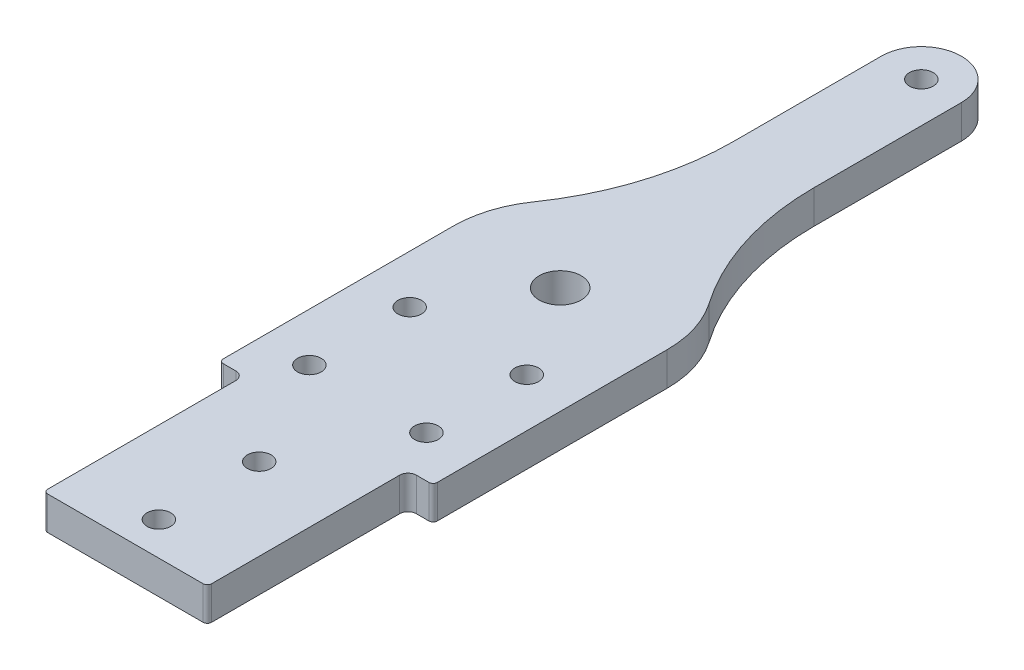
ISO-10303-21;
HEADER;
FILE_DESCRIPTION(('STEP AP214'),'2;1');
FILE_NAME('part.step','',(''),(''),'','','');
FILE_SCHEMA(('AUTOMOTIVE_DESIGN { 1 0 10303 214 1 1 1 1 }'));
ENDSEC;
DATA;
#1=APPLICATION_CONTEXT('core data for automotive mechanical design processes');
#2=APPLICATION_PROTOCOL_DEFINITION('international standard','automotive_design',2000,#1);
#3=PRODUCT_CONTEXT('',#1,'mechanical');
#4=PRODUCT('Part','Part','',(#3));
#5=PRODUCT_RELATED_PRODUCT_CATEGORY('part','',(#4));
#6=PRODUCT_DEFINITION_FORMATION('','',#4);
#7=PRODUCT_DEFINITION_CONTEXT('part definition',#1,'design');
#8=PRODUCT_DEFINITION('design','',#6,#7);
#9=PRODUCT_DEFINITION_SHAPE('','',#8);
#10=(LENGTH_UNIT() NAMED_UNIT(*) SI_UNIT(.MILLI.,.METRE.));
#11=(NAMED_UNIT(*) PLANE_ANGLE_UNIT() SI_UNIT($,.RADIAN.));
#12=(NAMED_UNIT(*) SI_UNIT($,.STERADIAN.) SOLID_ANGLE_UNIT());
#13=UNCERTAINTY_MEASURE_WITH_UNIT(LENGTH_MEASURE(1.E-05),#10,'distance_accuracy_value','');
#14=(GEOMETRIC_REPRESENTATION_CONTEXT(3) GLOBAL_UNCERTAINTY_ASSIGNED_CONTEXT((#13)) GLOBAL_UNIT_ASSIGNED_CONTEXT((#10,
#11,#12)) REPRESENTATION_CONTEXT('',''));
#15=CARTESIAN_POINT('',(0.,0.,0.));
#16=DIRECTION('',(0.,0.,1.));
#17=DIRECTION('',(1.,0.,0.));
#18=AXIS2_PLACEMENT_3D('',#15,#16,#17);
#19=CARTESIAN_POINT('',(14.7542598666683,-3.175,235.064400000001));
#20=DIRECTION('',(0.,1.,0.));
#21=DIRECTION('',(0.,0.,1.));
#22=AXIS2_PLACEMENT_3D('',#19,#20,#21);
#23=CYLINDRICAL_SURFACE('',#22,0.8);
#24=CARTESIAN_POINT('',(14.7542598666683,-3.175,235.064400000001));
#25=DIRECTION('',(0.,1.,0.));
#26=DIRECTION('',(0.,0.,1.));
#27=AXIS2_PLACEMENT_3D('',#24,#25,#26);
#28=CIRCLE('',#27,0.8);
#29=CARTESIAN_POINT('',(14.7542598666683,-3.175,235.864400000001));
#30=VERTEX_POINT('',#29);
#31=CARTESIAN_POINT('',(15.5542598666683,-3.175,235.064400000001));
#32=VERTEX_POINT('',#31);
#33=EDGE_CURVE('E343',#30,#32,#28,.T.);
#34=ORIENTED_EDGE('',*,*,#33,.T.);
#35=DIRECTION('',(0.,1.,0.));
#36=VECTOR('',#35,1.);
#37=CARTESIAN_POINT('',(15.5542598666683,-3.175,235.064400000001));
#38=LINE('',#37,#36);
#39=CARTESIAN_POINT('',(15.5542598666683,3.175,235.064400000001));
#40=VERTEX_POINT('',#39);
#41=EDGE_CURVE('E159',#40,#32,#38,.F.);
#42=ORIENTED_EDGE('',*,*,#41,.F.);
#43=CARTESIAN_POINT('',(14.7542598666683,3.175,235.064400000001));
#44=DIRECTION('',(0.,1.,0.));
#45=DIRECTION('',(0.,0.,1.));
#46=AXIS2_PLACEMENT_3D('',#43,#44,#45);
#47=CIRCLE('',#46,0.8);
#48=CARTESIAN_POINT('',(14.7542598666683,3.175,235.864400000001));
#49=VERTEX_POINT('',#48);
#50=EDGE_CURVE('E20',#40,#49,#47,.F.);
#51=ORIENTED_EDGE('',*,*,#50,.T.);
#52=DIRECTION('',(0.,1.,0.));
#53=VECTOR('',#52,1.);
#54=CARTESIAN_POINT('',(14.7542598666683,-3.175,235.864400000001));
#55=LINE('',#54,#53);
#56=EDGE_CURVE('E156',#30,#49,#55,.T.);
#57=ORIENTED_EDGE('',*,*,#56,.F.);
#58=EDGE_LOOP('',(#34,#42,#51,#57));
#59=FACE_BOUND('',#58,.T.);
#60=ADVANCED_FACE('F17',(#59),#23,.T.);
#61=CARTESIAN_POINT('',(19.52,0.,196.964400000001));
#62=DIRECTION('',(0.,1.,0.));
#63=DIRECTION('',(0.,0.,1.));
#64=AXIS2_PLACEMENT_3D('',#61,#62,#63);
#65=CYLINDRICAL_SURFACE('',#64,0.8);
#66=CARTESIAN_POINT('',(19.52,-3.175,196.964400000001));
#67=DIRECTION('',(0.,1.,0.));
#68=DIRECTION('',(0.,0.,1.));
#69=AXIS2_PLACEMENT_3D('',#66,#67,#68);
#70=CIRCLE('',#69,0.8);
#71=CARTESIAN_POINT('',(19.52,-3.175,197.764400000001));
#72=VERTEX_POINT('',#71);
#73=CARTESIAN_POINT('',(20.32,-3.175,196.964400000001));
#74=VERTEX_POINT('',#73);
#75=EDGE_CURVE('E341',#72,#74,#70,.T.);
#76=ORIENTED_EDGE('',*,*,#75,.T.);
#77=DIRECTION('',(0.,1.,0.));
#78=VECTOR('',#77,1.);
#79=CARTESIAN_POINT('',(20.32,0.,196.964400000001));
#80=LINE('',#79,#78);
#81=CARTESIAN_POINT('',(20.32,3.175,196.964400000001));
#82=VERTEX_POINT('',#81);
#83=EDGE_CURVE('E231',#82,#74,#80,.F.);
#84=ORIENTED_EDGE('',*,*,#83,.F.);
#85=CARTESIAN_POINT('',(19.52,3.175,196.964400000001));
#86=DIRECTION('',(0.,1.,0.));
#87=DIRECTION('',(0.,0.,1.));
#88=AXIS2_PLACEMENT_3D('',#85,#86,#87);
#89=CIRCLE('',#88,0.8);
#90=CARTESIAN_POINT('',(19.52,3.175,197.764400000001));
#91=VERTEX_POINT('',#90);
#92=EDGE_CURVE('E161',#82,#91,#89,.F.);
#93=ORIENTED_EDGE('',*,*,#92,.T.);
#94=DIRECTION('',(0.,1.,0.));
#95=VECTOR('',#94,1.);
#96=CARTESIAN_POINT('',(19.52,0.,197.764400000001));
#97=LINE('',#96,#95);
#98=EDGE_CURVE('E238',#72,#91,#97,.T.);
#99=ORIENTED_EDGE('',*,*,#98,.F.);
#100=EDGE_LOOP('',(#76,#84,#93,#99));
#101=FACE_BOUND('',#100,.T.);
#102=ADVANCED_FACE('F349',(#101),#65,.T.);
#103=CARTESIAN_POINT('',(-19.52,0.,196.964400000001));
#104=DIRECTION('',(0.,1.,0.));
#105=DIRECTION('',(0.,0.,1.));
#106=AXIS2_PLACEMENT_3D('',#103,#104,#105);
#107=CYLINDRICAL_SURFACE('',#106,0.8);
#108=CARTESIAN_POINT('',(-19.52,-3.175,196.964400000001));
#109=DIRECTION('',(0.,1.,0.));
#110=DIRECTION('',(0.,0.,1.));
#111=AXIS2_PLACEMENT_3D('',#108,#109,#110);
#112=CIRCLE('',#111,0.8);
#113=CARTESIAN_POINT('',(-20.32,-3.175,196.964400000001));
#114=VERTEX_POINT('',#113);
#115=CARTESIAN_POINT('',(-19.52,-3.175,197.764400000001));
#116=VERTEX_POINT('',#115);
#117=EDGE_CURVE('E339',#114,#116,#112,.T.);
#118=ORIENTED_EDGE('',*,*,#117,.T.);
#119=DIRECTION('',(0.,1.,0.));
#120=VECTOR('',#119,1.);
#121=CARTESIAN_POINT('',(-19.52,0.,197.764400000001));
#122=LINE('',#121,#120);
#123=CARTESIAN_POINT('',(-19.52,3.175,197.764400000001));
#124=VERTEX_POINT('',#123);
#125=EDGE_CURVE('E194',#124,#116,#122,.F.);
#126=ORIENTED_EDGE('',*,*,#125,.F.);
#127=CARTESIAN_POINT('',(-19.52,3.175,196.964400000001));
#128=DIRECTION('',(0.,1.,0.));
#129=DIRECTION('',(0.,0.,1.));
#130=AXIS2_PLACEMENT_3D('',#127,#128,#129);
#131=CIRCLE('',#130,0.8);
#132=CARTESIAN_POINT('',(-20.3200000000003,3.175,196.964400000001));
#133=VERTEX_POINT('',#132);
#134=EDGE_CURVE('E346',#124,#133,#131,.F.);
#135=ORIENTED_EDGE('',*,*,#134,.T.);
#136=DIRECTION('',(0.,1.,0.));
#137=VECTOR('',#136,1.);
#138=CARTESIAN_POINT('',(-20.32,0.,196.964400000001));
#139=LINE('',#138,#137);
#140=EDGE_CURVE('E201',#114,#133,#139,.T.);
#141=ORIENTED_EDGE('',*,*,#140,.F.);
#142=EDGE_LOOP('',(#118,#126,#135,#141));
#143=FACE_BOUND('',#142,.T.);
#144=ADVANCED_FACE('F420',(#143),#107,.T.);
#145=CARTESIAN_POINT('',(-14.7542598666683,-3.175,235.064400000001));
#146=DIRECTION('',(0.,1.,0.));
#147=DIRECTION('',(0.,0.,1.));
#148=AXIS2_PLACEMENT_3D('',#145,#146,#147);
#149=CYLINDRICAL_SURFACE('',#148,0.8);
#150=CARTESIAN_POINT('',(-14.7542598666683,-3.175,235.064400000001));
#151=DIRECTION('',(0.,1.,0.));
#152=DIRECTION('',(0.,0.,1.));
#153=AXIS2_PLACEMENT_3D('',#150,#151,#152);
#154=CIRCLE('',#153,0.8);
#155=CARTESIAN_POINT('',(-15.5542598666683,-3.175,235.064400000001));
#156=VERTEX_POINT('',#155);
#157=CARTESIAN_POINT('',(-14.7542598666683,-3.175,235.864400000001));
#158=VERTEX_POINT('',#157);
#159=EDGE_CURVE('E247',#156,#158,#154,.T.);
#160=ORIENTED_EDGE('',*,*,#159,.T.);
#161=DIRECTION('',(0.,1.,0.));
#162=VECTOR('',#161,1.);
#163=CARTESIAN_POINT('',(-14.7542598666683,-3.175,235.864400000001));
#164=LINE('',#163,#162);
#165=CARTESIAN_POINT('',(-14.7542598666683,3.175,235.864400000001));
#166=VERTEX_POINT('',#165);
#167=EDGE_CURVE('E246',#166,#158,#164,.F.);
#168=ORIENTED_EDGE('',*,*,#167,.F.);
#169=CARTESIAN_POINT('',(-14.7542598666683,3.175,235.064400000001));
#170=DIRECTION('',(0.,1.,0.));
#171=DIRECTION('',(0.,0.,1.));
#172=AXIS2_PLACEMENT_3D('',#169,#170,#171);
#173=CIRCLE('',#172,0.8);
#174=CARTESIAN_POINT('',(-15.5542598666683,3.175,235.064400000001));
#175=VERTEX_POINT('',#174);
#176=EDGE_CURVE('E173',#166,#175,#173,.F.);
#177=ORIENTED_EDGE('',*,*,#176,.T.);
#178=DIRECTION('',(0.,1.,0.));
#179=VECTOR('',#178,1.);
#180=CARTESIAN_POINT('',(-15.5542598666683,-3.175,235.064400000001));
#181=LINE('',#180,#179);
#182=EDGE_CURVE('E187',#156,#175,#181,.T.);
#183=ORIENTED_EDGE('',*,*,#182,.F.);
#184=EDGE_LOOP('',(#160,#168,#177,#183));
#185=FACE_BOUND('',#184,.T.);
#186=ADVANCED_FACE('F374',(#185),#149,.T.);
#187=CARTESIAN_POINT('',(-2.30926389122033E-13,-3.175,137.4394));
#188=DIRECTION('',(0.,1.,0.));
#189=DIRECTION('',(0.,0.,1.));
#190=AXIS2_PLACEMENT_3D('',#187,#188,#189);
#191=PLANE('',#190);
#192=CARTESIAN_POINT('',(0.,-3.175,153.3144));
#193=DIRECTION('',(0.,1.,0.));
#194=DIRECTION('',(0.,0.,1.));
#195=AXIS2_PLACEMENT_3D('',#192,#193,#194);
#196=CIRCLE('',#195,4.);
#197=CARTESIAN_POINT('',(0.,-3.175,157.3144));
#198=VERTEX_POINT('',#197);
#199=EDGE_CURVE('E176',#198,#198,#196,.T.);
#200=ORIENTED_EDGE('',*,*,#199,.T.);
#201=EDGE_LOOP('',(#200));
#202=FACE_BOUND('',#201,.T.);
#203=CARTESIAN_POINT('',(-11.1125,-3.175,189.826900000001));
#204=DIRECTION('',(0.,-1.,0.));
#205=DIRECTION('',(0.,0.,-1.));
#206=AXIS2_PLACEMENT_3D('',#203,#204,#205);
#207=CIRCLE('',#206,2.2479);
#208=CARTESIAN_POINT('',(-11.1125,-3.175,187.579000000001));
#209=VERTEX_POINT('',#208);
#210=EDGE_CURVE('E181',#209,#209,#207,.F.);
#211=ORIENTED_EDGE('',*,*,#210,.T.);
#212=EDGE_LOOP('',(#211));
#213=FACE_BOUND('',#212,.T.);
#214=CARTESIAN_POINT('',(11.1125,-3.175,189.826900000001));
#215=DIRECTION('',(0.,-1.,0.));
#216=DIRECTION('',(0.,0.,-1.));
#217=AXIS2_PLACEMENT_3D('',#214,#215,#216);
#218=CIRCLE('',#217,2.2479);
#219=CARTESIAN_POINT('',(11.1125,-3.175,187.579000000001));
#220=VERTEX_POINT('',#219);
#221=EDGE_CURVE('E312',#220,#220,#218,.F.);
#222=ORIENTED_EDGE('',*,*,#221,.T.);
#223=EDGE_LOOP('',(#222));
#224=FACE_BOUND('',#223,.T.);
#225=CARTESIAN_POINT('',(0.,-3.175,84.7344));
#226=DIRECTION('',(0.,-1.,0.));
#227=DIRECTION('',(0.,0.,-1.));
#228=AXIS2_PLACEMENT_3D('',#225,#226,#227);
#229=CIRCLE('',#228,2.2479);
#230=CARTESIAN_POINT('',(0.,-3.175,82.4865));
#231=VERTEX_POINT('',#230);
#232=EDGE_CURVE('E315',#231,#231,#229,.F.);
#233=ORIENTED_EDGE('',*,*,#232,.T.);
#234=EDGE_LOOP('',(#233));
#235=FACE_BOUND('',#234,.T.);
#236=CARTESIAN_POINT('',(0.,-3.175,210.464400000001));
#237=DIRECTION('',(0.,1.,0.));
#238=DIRECTION('',(0.,0.,1.));
#239=AXIS2_PLACEMENT_3D('',#236,#237,#238);
#240=CIRCLE('',#239,2.2479);
#241=CARTESIAN_POINT('',(0.,-3.175,212.712300000001));
#242=VERTEX_POINT('',#241);
#243=EDGE_CURVE('E318',#242,#242,#240,.T.);
#244=ORIENTED_EDGE('',*,*,#243,.T.);
#245=EDGE_LOOP('',(#244));
#246=FACE_BOUND('',#245,.T.);
#247=CARTESIAN_POINT('',(0.,-3.175,229.514400000001));
#248=DIRECTION('',(0.,1.,0.));
#249=DIRECTION('',(0.,0.,1.));
#250=AXIS2_PLACEMENT_3D('',#247,#248,#249);
#251=CIRCLE('',#250,2.2479);
#252=CARTESIAN_POINT('',(0.,-3.175,231.762300000001));
#253=VERTEX_POINT('',#252);
#254=EDGE_CURVE('E321',#253,#253,#251,.T.);
#255=ORIENTED_EDGE('',*,*,#254,.T.);
#256=EDGE_LOOP('',(#255));
#257=FACE_BOUND('',#256,.T.);
#258=CARTESIAN_POINT('',(-11.1125,-3.175,170.776900000001));
#259=DIRECTION('',(0.,-1.,0.));
#260=DIRECTION('',(0.,0.,-1.));
#261=AXIS2_PLACEMENT_3D('',#258,#259,#260);
#262=CIRCLE('',#261,2.25);
#263=CARTESIAN_POINT('',(-11.1125,-3.175,168.526900000001));
#264=VERTEX_POINT('',#263);
#265=EDGE_CURVE('E324',#264,#264,#262,.F.);
#266=ORIENTED_EDGE('',*,*,#265,.T.);
#267=EDGE_LOOP('',(#266));
#268=FACE_BOUND('',#267,.T.);
#269=CARTESIAN_POINT('',(11.1125,-3.175,170.776900000001));
#270=DIRECTION('',(0.,-1.,0.));
#271=DIRECTION('',(0.,0.,-1.));
#272=AXIS2_PLACEMENT_3D('',#269,#270,#271);
#273=CIRCLE('',#272,2.25);
#274=CARTESIAN_POINT('',(11.1125,-3.175,168.526900000001));
#275=VERTEX_POINT('',#274);
#276=EDGE_CURVE('E251',#275,#275,#273,.F.);
#277=ORIENTED_EDGE('',*,*,#276,.T.);
#278=EDGE_LOOP('',(#277));
#279=FACE_BOUND('',#278,.T.);
#280=DIRECTION('',(0.,0.,1.));
#281=VECTOR('',#280,1.);
#282=CARTESIAN_POINT('',(-15.5542598666683,-3.175,197.764400000001));
#283=LINE('',#282,#281);
#284=CARTESIAN_POINT('',(-15.5542598666683,-3.175,199.351900000001));
#285=VERTEX_POINT('',#284);
#286=EDGE_CURVE('E186',#285,#156,#283,.T.);
#287=ORIENTED_EDGE('',*,*,#286,.F.);
#288=CARTESIAN_POINT('',(-17.1417598666683,-3.175,199.351900000001));
#289=DIRECTION('',(0.,1.,0.));
#290=DIRECTION('',(0.,0.,1.));
#291=AXIS2_PLACEMENT_3D('',#288,#289,#290);
#292=CIRCLE('',#291,1.5875);
#293=CARTESIAN_POINT('',(-17.1417598666683,-3.175,197.764400000001));
#294=VERTEX_POINT('',#293);
#295=EDGE_CURVE('E190',#285,#294,#292,.T.);
#296=ORIENTED_EDGE('',*,*,#295,.T.);
#297=DIRECTION('',(1.,0.,0.));
#298=VECTOR('',#297,1.);
#299=CARTESIAN_POINT('',(-20.32,-3.175,197.764400000001));
#300=LINE('',#299,#298);
#301=EDGE_CURVE('E193',#116,#294,#300,.T.);
#302=ORIENTED_EDGE('',*,*,#301,.F.);
#303=ORIENTED_EDGE('',*,*,#117,.F.);
#304=DIRECTION('',(0.,0.,1.));
#305=VECTOR('',#304,1.);
#306=CARTESIAN_POINT('',(-20.32,-3.175,153.3144));
#307=LINE('',#306,#305);
#308=CARTESIAN_POINT('',(-20.32,-3.175,153.3144));
#309=VERTEX_POINT('',#308);
#310=EDGE_CURVE('E197',#309,#114,#307,.T.);
#311=ORIENTED_EDGE('',*,*,#310,.F.);
#312=CARTESIAN_POINT('',(0.,-3.175,153.3144));
#313=DIRECTION('',(0.,1.,0.));
#314=DIRECTION('',(0.,0.,1.));
#315=AXIS2_PLACEMENT_3D('',#312,#313,#314);
#316=CIRCLE('',#315,20.3200000000005);
#317=CARTESIAN_POINT('',(-16.6914285714293,-3.175,141.725672190404));
#318=VERTEX_POINT('',#317);
#319=EDGE_CURVE('E204',#318,#309,#316,.T.);
#320=ORIENTED_EDGE('',*,*,#319,.F.);
#321=CARTESIAN_POINT('',(-58.4200000000018,-3.175,112.753852666417));
#322=DIRECTION('',(0.,1.,0.));
#323=DIRECTION('',(0.,0.,1.));
#324=AXIS2_PLACEMENT_3D('',#321,#322,#323);
#325=CIRCLE('',#324,50.8);
#326=CARTESIAN_POINT('',(-7.62000000000183,-3.175,112.75385266642));
#327=VERTEX_POINT('',#326);
#328=EDGE_CURVE('E210',#318,#327,#325,.T.);
#329=ORIENTED_EDGE('',*,*,#328,.T.);
#330=DIRECTION('',(0.,0.,1.));
#331=VECTOR('',#330,1.);
#332=CARTESIAN_POINT('',(-7.61999999999992,-3.175,84.7343999999995));
#333=LINE('',#332,#331);
#334=CARTESIAN_POINT('',(-7.61999999999992,-3.175,84.7343999999995));
#335=VERTEX_POINT('',#334);
#336=EDGE_CURVE('E214',#335,#327,#333,.T.);
#337=ORIENTED_EDGE('',*,*,#336,.F.);
#338=CARTESIAN_POINT('',(0.,-3.175,84.7344));
#339=DIRECTION('',(0.,1.,0.));
#340=DIRECTION('',(0.,0.,1.));
#341=AXIS2_PLACEMENT_3D('',#338,#339,#340);
#342=CIRCLE('',#341,7.61999999999992);
#343=CARTESIAN_POINT('',(7.62000000000091,-3.175,84.7343999999998));
#344=VERTEX_POINT('',#343);
#345=EDGE_CURVE('E215',#344,#335,#342,.T.);
#346=ORIENTED_EDGE('',*,*,#345,.F.);
#347=DIRECTION('',(0.,0.,-1.));
#348=VECTOR('',#347,1.);
#349=CARTESIAN_POINT('',(7.62000000000152,-3.175,112.75385266642));
#350=LINE('',#349,#348);
#351=CARTESIAN_POINT('',(7.62000000000152,-3.175,112.753852666418));
#352=VERTEX_POINT('',#351);
#353=EDGE_CURVE('E219',#352,#344,#350,.T.);
#354=ORIENTED_EDGE('',*,*,#353,.F.);
#355=CARTESIAN_POINT('',(58.4200000000018,-3.175,112.753852666417));
#356=DIRECTION('',(0.,1.,0.));
#357=DIRECTION('',(0.,0.,1.));
#358=AXIS2_PLACEMENT_3D('',#355,#356,#357);
#359=CIRCLE('',#358,50.8);
#360=CARTESIAN_POINT('',(16.6914285714293,-3.175,141.725672190404));
#361=VERTEX_POINT('',#360);
#362=EDGE_CURVE('E225',#352,#361,#359,.T.);
#363=ORIENTED_EDGE('',*,*,#362,.T.);
#364=CARTESIAN_POINT('',(0.,-3.175,153.3144));
#365=DIRECTION('',(0.,1.,0.));
#366=DIRECTION('',(0.,0.,1.));
#367=AXIS2_PLACEMENT_3D('',#364,#365,#366);
#368=CIRCLE('',#367,20.32);
#369=CARTESIAN_POINT('',(20.32,-3.175,153.3144));
#370=VERTEX_POINT('',#369);
#371=EDGE_CURVE('E229',#370,#361,#368,.T.);
#372=ORIENTED_EDGE('',*,*,#371,.F.);
#373=DIRECTION('',(0.,0.,-1.));
#374=VECTOR('',#373,1.);
#375=CARTESIAN_POINT('',(20.32,-3.175,197.764400000001));
#376=LINE('',#375,#374);
#377=EDGE_CURVE('E230',#74,#370,#376,.T.);
#378=ORIENTED_EDGE('',*,*,#377,.F.);
#379=ORIENTED_EDGE('',*,*,#75,.F.);
#380=DIRECTION('',(1.,0.,0.));
#381=VECTOR('',#380,1.);
#382=CARTESIAN_POINT('',(-20.32,-3.175,197.764400000001));
#383=LINE('',#382,#381);
#384=CARTESIAN_POINT('',(17.1417598666683,-3.175,197.764400000001));
#385=VERTEX_POINT('',#384);
#386=EDGE_CURVE('E234',#385,#72,#383,.T.);
#387=ORIENTED_EDGE('',*,*,#386,.F.);
#388=CARTESIAN_POINT('',(17.1417598666683,-3.175,199.351900000001));
#389=DIRECTION('',(0.,-1.,0.));
#390=DIRECTION('',(0.,0.,-1.));
#391=AXIS2_PLACEMENT_3D('',#388,#389,#390);
#392=CIRCLE('',#391,1.5875);
#393=CARTESIAN_POINT('',(15.5542598666683,-3.175,199.351900000001));
#394=VERTEX_POINT('',#393);
#395=EDGE_CURVE('E243',#385,#394,#392,.F.);
#396=ORIENTED_EDGE('',*,*,#395,.T.);
#397=DIRECTION('',(0.,0.,-1.));
#398=VECTOR('',#397,1.);
#399=CARTESIAN_POINT('',(15.5542598666683,-3.175,235.864400000001));
#400=LINE('',#399,#398);
#401=EDGE_CURVE('E245',#32,#394,#400,.T.);
#402=ORIENTED_EDGE('',*,*,#401,.F.);
#403=ORIENTED_EDGE('',*,*,#33,.F.);
#404=DIRECTION('',(1.,0.,0.));
#405=VECTOR('',#404,1.);
#406=CARTESIAN_POINT('',(-15.5542598666683,-3.175,235.864400000001));
#407=LINE('',#406,#405);
#408=EDGE_CURVE('E168',#158,#30,#407,.T.);
#409=ORIENTED_EDGE('',*,*,#408,.F.);
#410=ORIENTED_EDGE('',*,*,#159,.F.);
#411=EDGE_LOOP('',(#287,#296,#302,#303,#311,#320,#329,#337,#346,#354,#363,#372,#378,#379,#387,
#396,#402,#403,#409,#410));
#412=FACE_BOUND('',#411,.T.);
#413=ADVANCED_FACE('F376',(#202,#213,#224,#235,#246,#257,#268,#279,#412),#191,.F.);
#414=CARTESIAN_POINT('',(-15.5542598666683,-3.175,235.864400000001));
#415=DIRECTION('',(0.,0.,1.));
#416=DIRECTION('',(1.,0.,0.));
#417=AXIS2_PLACEMENT_3D('',#414,#415,#416);
#418=PLANE('',#417);
#419=ORIENTED_EDGE('',*,*,#56,.T.);
#420=DIRECTION('',(1.,0.,0.));
#421=VECTOR('',#420,1.);
#422=CARTESIAN_POINT('',(-2.30926389122033E-13,3.175,235.864400000001));
#423=LINE('',#422,#421);
#424=EDGE_CURVE('E166',#166,#49,#423,.T.);
#425=ORIENTED_EDGE('',*,*,#424,.F.);
#426=ORIENTED_EDGE('',*,*,#167,.T.);
#427=ORIENTED_EDGE('',*,*,#408,.T.);
#428=EDGE_LOOP('',(#419,#425,#426,#427));
#429=FACE_BOUND('',#428,.T.);
#430=ADVANCED_FACE('F164',(#429),#418,.T.);
#431=CARTESIAN_POINT('',(15.5542598666683,-3.175,235.864400000001));
#432=DIRECTION('',(1.,0.,0.));
#433=DIRECTION('',(0.,0.,-1.));
#434=AXIS2_PLACEMENT_3D('',#431,#432,#433);
#435=PLANE('',#434);
#436=DIRECTION('',(0.,-1.,0.));
#437=VECTOR('',#436,1.);
#438=CARTESIAN_POINT('',(15.5542598666683,-1.5875,199.351900000001));
#439=LINE('',#438,#437);
#440=CARTESIAN_POINT('',(15.5542598666683,3.175,199.351900000001));
#441=VERTEX_POINT('',#440);
#442=EDGE_CURVE('E241',#394,#441,#439,.F.);
#443=ORIENTED_EDGE('',*,*,#442,.T.);
#444=DIRECTION('',(0.,0.,1.));
#445=VECTOR('',#444,1.);
#446=CARTESIAN_POINT('',(15.5542598666683,3.175,137.4394));
#447=LINE('',#446,#445);
#448=EDGE_CURVE('E175',#40,#441,#447,.F.);
#449=ORIENTED_EDGE('',*,*,#448,.F.);
#450=ORIENTED_EDGE('',*,*,#41,.T.);
#451=ORIENTED_EDGE('',*,*,#401,.T.);
#452=EDGE_LOOP('',(#443,#449,#450,#451));
#453=FACE_BOUND('',#452,.T.);
#454=ADVANCED_FACE('F380',(#453),#435,.T.);
#455=CARTESIAN_POINT('',(17.1417598666683,-1.5875,199.351900000001));
#456=DIRECTION('',(0.,-1.,0.));
#457=DIRECTION('',(0.,0.,-1.));
#458=AXIS2_PLACEMENT_3D('',#455,#456,#457);
#459=CYLINDRICAL_SURFACE('',#458,1.5875);
#460=ORIENTED_EDGE('',*,*,#442,.F.);
#461=ORIENTED_EDGE('',*,*,#395,.F.);
#462=DIRECTION('',(0.,1.,0.));
#463=VECTOR('',#462,1.);
#464=CARTESIAN_POINT('',(17.1417598666683,0.,197.764400000001));
#465=LINE('',#464,#463);
#466=CARTESIAN_POINT('',(17.1417598666683,3.175,197.764400000001));
#467=VERTEX_POINT('',#466);
#468=EDGE_CURVE('E235',#467,#385,#465,.F.);
#469=ORIENTED_EDGE('',*,*,#468,.F.);
#470=CARTESIAN_POINT('',(17.1417598666683,3.175,199.351900000001));
#471=DIRECTION('',(0.,-1.,0.));
#472=DIRECTION('',(0.,0.,-1.));
#473=AXIS2_PLACEMENT_3D('',#470,#471,#472);
#474=CIRCLE('',#473,1.5875);
#475=EDGE_CURVE('E178',#441,#467,#474,.T.);
#476=ORIENTED_EDGE('',*,*,#475,.F.);
#477=EDGE_LOOP('',(#460,#461,#469,#476));
#478=FACE_BOUND('',#477,.T.);
#479=ADVANCED_FACE('F382',(#478),#459,.F.);
#480=CARTESIAN_POINT('',(-20.32,0.,197.764400000001));
#481=DIRECTION('',(0.,0.,1.));
#482=DIRECTION('',(1.,0.,0.));
#483=AXIS2_PLACEMENT_3D('',#480,#481,#482);
#484=PLANE('',#483);
#485=ORIENTED_EDGE('',*,*,#468,.T.);
#486=ORIENTED_EDGE('',*,*,#386,.T.);
#487=ORIENTED_EDGE('',*,*,#98,.T.);
#488=DIRECTION('',(1.,0.,0.));
#489=VECTOR('',#488,1.);
#490=CARTESIAN_POINT('',(-2.30926389122033E-13,3.175,197.764400000001));
#491=LINE('',#490,#489);
#492=EDGE_CURVE('E308',#467,#91,#491,.T.);
#493=ORIENTED_EDGE('',*,*,#492,.F.);
#494=EDGE_LOOP('',(#485,#486,#487,#493));
#495=FACE_BOUND('',#494,.T.);
#496=ADVANCED_FACE('F356',(#495),#484,.T.);
#497=CARTESIAN_POINT('',(20.32,0.,197.764400000001));
#498=DIRECTION('',(1.,0.,0.));
#499=DIRECTION('',(0.,0.,-1.));
#500=AXIS2_PLACEMENT_3D('',#497,#498,#499);
#501=PLANE('',#500);
#502=DIRECTION('',(0.,1.,0.));
#503=VECTOR('',#502,1.);
#504=CARTESIAN_POINT('',(20.32,0.,153.3144));
#505=LINE('',#504,#503);
#506=CARTESIAN_POINT('',(20.32,3.175,153.3144));
#507=VERTEX_POINT('',#506);
#508=EDGE_CURVE('E226',#507,#370,#505,.F.);
#509=ORIENTED_EDGE('',*,*,#508,.F.);
#510=DIRECTION('',(0.,0.,1.));
#511=VECTOR('',#510,1.);
#512=CARTESIAN_POINT('',(20.32,3.175,137.4394));
#513=LINE('',#512,#511);
#514=EDGE_CURVE('E306',#82,#507,#513,.F.);
#515=ORIENTED_EDGE('',*,*,#514,.F.);
#516=ORIENTED_EDGE('',*,*,#83,.T.);
#517=ORIENTED_EDGE('',*,*,#377,.T.);
#518=EDGE_LOOP('',(#509,#515,#516,#517));
#519=FACE_BOUND('',#518,.T.);
#520=ADVANCED_FACE('F386',(#519),#501,.T.);
#521=CARTESIAN_POINT('',(0.,0.,153.3144));
#522=DIRECTION('',(0.,1.,0.));
#523=DIRECTION('',(0.,0.,1.));
#524=AXIS2_PLACEMENT_3D('',#521,#522,#523);
#525=CYLINDRICAL_SURFACE('',#524,20.32);
#526=ORIENTED_EDGE('',*,*,#508,.T.);
#527=ORIENTED_EDGE('',*,*,#371,.T.);
#528=DIRECTION('',(0.,1.,0.));
#529=VECTOR('',#528,1.);
#530=CARTESIAN_POINT('',(16.6914285714292,0.,141.725672190404));
#531=LINE('',#530,#529);
#532=CARTESIAN_POINT('',(16.6914285714293,3.175,141.725672190404));
#533=VERTEX_POINT('',#532);
#534=EDGE_CURVE('E223',#361,#533,#531,.T.);
#535=ORIENTED_EDGE('',*,*,#534,.T.);
#536=CARTESIAN_POINT('',(0.,3.175,153.3144));
#537=DIRECTION('',(0.,1.,0.));
#538=DIRECTION('',(0.,0.,1.));
#539=AXIS2_PLACEMENT_3D('',#536,#537,#538);
#540=CIRCLE('',#539,20.32);
#541=EDGE_CURVE('E303',#507,#533,#540,.T.);
#542=ORIENTED_EDGE('',*,*,#541,.F.);
#543=EDGE_LOOP('',(#526,#527,#535,#542));
#544=FACE_BOUND('',#543,.T.);
#545=ADVANCED_FACE('F390',(#544),#525,.T.);
#546=CARTESIAN_POINT('',(58.4200000000018,0.,112.753852666417));
#547=DIRECTION('',(0.,1.,0.));
#548=DIRECTION('',(0.,0.,1.));
#549=AXIS2_PLACEMENT_3D('',#546,#547,#548);
#550=CYLINDRICAL_SURFACE('',#549,50.8);
#551=CARTESIAN_POINT('',(58.4200000000018,3.175,112.753852666417));
#552=DIRECTION('',(0.,1.,0.));
#553=DIRECTION('',(0.,0.,1.));
#554=AXIS2_PLACEMENT_3D('',#551,#552,#553);
#555=CIRCLE('',#554,50.8);
#556=CARTESIAN_POINT('',(7.6200000000017,3.175,112.753852666418));
#557=VERTEX_POINT('',#556);
#558=EDGE_CURVE('E300',#533,#557,#555,.F.);
#559=ORIENTED_EDGE('',*,*,#558,.F.);
#560=ORIENTED_EDGE('',*,*,#534,.F.);
#561=ORIENTED_EDGE('',*,*,#362,.F.);
#562=DIRECTION('',(0.,1.,0.));
#563=VECTOR('',#562,1.);
#564=CARTESIAN_POINT('',(7.62000000000152,0.,112.75385266642));
#565=LINE('',#564,#563);
#566=EDGE_CURVE('E220',#557,#352,#565,.F.);
#567=ORIENTED_EDGE('',*,*,#566,.F.);
#568=EDGE_LOOP('',(#559,#560,#561,#567));
#569=FACE_BOUND('',#568,.T.);
#570=ADVANCED_FACE('F393',(#569),#550,.F.);
#571=CARTESIAN_POINT('',(7.62000000000152,0.,112.75385266642));
#572=DIRECTION('',(1.,0.,0.));
#573=DIRECTION('',(0.,0.,-1.));
#574=AXIS2_PLACEMENT_3D('',#571,#572,#573);
#575=PLANE('',#574);
#576=ORIENTED_EDGE('',*,*,#566,.T.);
#577=ORIENTED_EDGE('',*,*,#353,.T.);
#578=DIRECTION('',(0.,1.,0.));
#579=VECTOR('',#578,1.);
#580=CARTESIAN_POINT('',(7.61999999999992,0.,84.7343999999995));
#581=LINE('',#580,#579);
#582=CARTESIAN_POINT('',(7.6200000000009,3.175,84.7343999999997));
#583=VERTEX_POINT('',#582);
#584=EDGE_CURVE('E216',#583,#344,#581,.F.);
#585=ORIENTED_EDGE('',*,*,#584,.F.);
#586=DIRECTION('',(0.,0.,1.));
#587=VECTOR('',#586,1.);
#588=CARTESIAN_POINT('',(7.62000000000188,3.175,137.4394));
#589=LINE('',#588,#587);
#590=EDGE_CURVE('E299',#557,#583,#589,.F.);
#591=ORIENTED_EDGE('',*,*,#590,.F.);
#592=EDGE_LOOP('',(#576,#577,#585,#591));
#593=FACE_BOUND('',#592,.T.);
#594=ADVANCED_FACE('F397',(#593),#575,.T.);
#595=CARTESIAN_POINT('',(0.,0.,84.7344));
#596=DIRECTION('',(0.,1.,0.));
#597=DIRECTION('',(0.,0.,1.));
#598=AXIS2_PLACEMENT_3D('',#595,#596,#597);
#599=CYLINDRICAL_SURFACE('',#598,7.61999999999992);
#600=ORIENTED_EDGE('',*,*,#584,.T.);
#601=ORIENTED_EDGE('',*,*,#345,.T.);
#602=DIRECTION('',(0.,1.,0.));
#603=VECTOR('',#602,1.);
#604=CARTESIAN_POINT('',(-7.61999999999992,0.,84.7343999999995));
#605=LINE('',#604,#603);
#606=CARTESIAN_POINT('',(-7.61999999999992,3.175,84.7343999999997));
#607=VERTEX_POINT('',#606);
#608=EDGE_CURVE('E211',#607,#335,#605,.F.);
#609=ORIENTED_EDGE('',*,*,#608,.F.);
#610=CARTESIAN_POINT('',(0.,3.175,84.7344));
#611=DIRECTION('',(0.,1.,0.));
#612=DIRECTION('',(0.,0.,1.));
#613=AXIS2_PLACEMENT_3D('',#610,#611,#612);
#614=CIRCLE('',#613,7.61999999999992);
#615=EDGE_CURVE('E296',#583,#607,#614,.T.);
#616=ORIENTED_EDGE('',*,*,#615,.F.);
#617=EDGE_LOOP('',(#600,#601,#609,#616));
#618=FACE_BOUND('',#617,.T.);
#619=ADVANCED_FACE('F401',(#618),#599,.T.);
#620=CARTESIAN_POINT('',(-7.61999999999992,0.,84.7343999999995));
#621=DIRECTION('',(-1.,0.,0.));
#622=DIRECTION('',(0.,0.,1.));
#623=AXIS2_PLACEMENT_3D('',#620,#621,#622);
#624=PLANE('',#623);
#625=ORIENTED_EDGE('',*,*,#608,.T.);
#626=ORIENTED_EDGE('',*,*,#336,.T.);
#627=DIRECTION('',(0.,1.,0.));
#628=VECTOR('',#627,1.);
#629=CARTESIAN_POINT('',(-7.62000000000178,0.,112.75385266642));
#630=LINE('',#629,#628);
#631=CARTESIAN_POINT('',(-7.62000000000085,3.175,112.753852666418));
#632=VERTEX_POINT('',#631);
#633=EDGE_CURVE('E208',#327,#632,#630,.T.);
#634=ORIENTED_EDGE('',*,*,#633,.T.);
#635=DIRECTION('',(0.,0.,1.));
#636=VECTOR('',#635,1.);
#637=CARTESIAN_POINT('',(-7.61999999999992,3.175,137.4394));
#638=LINE('',#637,#636);
#639=EDGE_CURVE('E295',#607,#632,#638,.T.);
#640=ORIENTED_EDGE('',*,*,#639,.F.);
#641=EDGE_LOOP('',(#625,#626,#634,#640));
#642=FACE_BOUND('',#641,.T.);
#643=ADVANCED_FACE('F405',(#642),#624,.T.);
#644=CARTESIAN_POINT('',(-58.4200000000018,0.,112.753852666417));
#645=DIRECTION('',(0.,1.,0.));
#646=DIRECTION('',(0.,0.,1.));
#647=AXIS2_PLACEMENT_3D('',#644,#645,#646);
#648=CYLINDRICAL_SURFACE('',#647,50.8);
#649=CARTESIAN_POINT('',(-58.4200000000018,3.175,112.753852666417));
#650=DIRECTION('',(0.,1.,0.));
#651=DIRECTION('',(0.,0.,1.));
#652=AXIS2_PLACEMENT_3D('',#649,#650,#651);
#653=CIRCLE('',#652,50.8);
#654=CARTESIAN_POINT('',(-16.6914285714293,3.175,141.725672190404));
#655=VERTEX_POINT('',#654);
#656=EDGE_CURVE('E292',#632,#655,#653,.F.);
#657=ORIENTED_EDGE('',*,*,#656,.F.);
#658=ORIENTED_EDGE('',*,*,#633,.F.);
#659=ORIENTED_EDGE('',*,*,#328,.F.);
#660=DIRECTION('',(0.,1.,0.));
#661=VECTOR('',#660,1.);
#662=CARTESIAN_POINT('',(-16.6914285714292,0.,141.725672190404));
#663=LINE('',#662,#661);
#664=EDGE_CURVE('E205',#655,#318,#663,.F.);
#665=ORIENTED_EDGE('',*,*,#664,.F.);
#666=EDGE_LOOP('',(#657,#658,#659,#665));
#667=FACE_BOUND('',#666,.T.);
#668=ADVANCED_FACE('F409',(#667),#648,.F.);
#669=CARTESIAN_POINT('',(0.,0.,153.3144));
#670=DIRECTION('',(0.,1.,0.));
#671=DIRECTION('',(0.,0.,1.));
#672=AXIS2_PLACEMENT_3D('',#669,#670,#671);
#673=CYLINDRICAL_SURFACE('',#672,20.3200000000005);
#674=ORIENTED_EDGE('',*,*,#664,.T.);
#675=ORIENTED_EDGE('',*,*,#319,.T.);
#676=DIRECTION('',(0.,1.,0.));
#677=VECTOR('',#676,1.);
#678=CARTESIAN_POINT('',(-20.32,0.,153.3144));
#679=LINE('',#678,#677);
#680=CARTESIAN_POINT('',(-20.3200000000003,3.175,153.3144));
#681=VERTEX_POINT('',#680);
#682=EDGE_CURVE('E198',#681,#309,#679,.F.);
#683=ORIENTED_EDGE('',*,*,#682,.F.);
#684=CARTESIAN_POINT('',(0.,3.175,153.3144));
#685=DIRECTION('',(0.,1.,0.));
#686=DIRECTION('',(0.,0.,1.));
#687=AXIS2_PLACEMENT_3D('',#684,#685,#686);
#688=CIRCLE('',#687,20.3200000000005);
#689=EDGE_CURVE('E288',#655,#681,#688,.T.);
#690=ORIENTED_EDGE('',*,*,#689,.F.);
#691=EDGE_LOOP('',(#674,#675,#683,#690));
#692=FACE_BOUND('',#691,.T.);
#693=ADVANCED_FACE('F413',(#692),#673,.T.);
#694=CARTESIAN_POINT('',(-20.32,0.,153.3144));
#695=DIRECTION('',(-1.,0.,0.));
#696=DIRECTION('',(0.,0.,1.));
#697=AXIS2_PLACEMENT_3D('',#694,#695,#696);
#698=PLANE('',#697);
#699=ORIENTED_EDGE('',*,*,#682,.T.);
#700=ORIENTED_EDGE('',*,*,#310,.T.);
#701=ORIENTED_EDGE('',*,*,#140,.T.);
#702=DIRECTION('',(0.,0.,1.));
#703=VECTOR('',#702,1.);
#704=CARTESIAN_POINT('',(-20.3200000000005,3.175,137.4394));
#705=LINE('',#704,#703);
#706=EDGE_CURVE('E291',#681,#133,#705,.T.);
#707=ORIENTED_EDGE('',*,*,#706,.F.);
#708=EDGE_LOOP('',(#699,#700,#701,#707));
#709=FACE_BOUND('',#708,.T.);
#710=ADVANCED_FACE('F417',(#709),#698,.T.);
#711=CARTESIAN_POINT('',(-20.32,0.,197.764400000001));
#712=DIRECTION('',(0.,0.,1.));
#713=DIRECTION('',(1.,0.,0.));
#714=AXIS2_PLACEMENT_3D('',#711,#712,#713);
#715=PLANE('',#714);
#716=DIRECTION('',(0.,1.,0.));
#717=VECTOR('',#716,1.);
#718=CARTESIAN_POINT('',(-17.1417598666683,-1.5875,197.764400000001));
#719=LINE('',#718,#717);
#720=CARTESIAN_POINT('',(-17.1417598666683,3.175,197.764400000001));
#721=VERTEX_POINT('',#720);
#722=EDGE_CURVE('E191',#294,#721,#719,.T.);
#723=ORIENTED_EDGE('',*,*,#722,.T.);
#724=DIRECTION('',(1.,0.,0.));
#725=VECTOR('',#724,1.);
#726=CARTESIAN_POINT('',(-2.30926389122033E-13,3.175,197.764400000001));
#727=LINE('',#726,#725);
#728=EDGE_CURVE('E287',#124,#721,#727,.T.);
#729=ORIENTED_EDGE('',*,*,#728,.F.);
#730=ORIENTED_EDGE('',*,*,#125,.T.);
#731=ORIENTED_EDGE('',*,*,#301,.T.);
#732=EDGE_LOOP('',(#723,#729,#730,#731));
#733=FACE_BOUND('',#732,.T.);
#734=ADVANCED_FACE('F426',(#733),#715,.T.);
#735=CARTESIAN_POINT('',(-17.1417598666683,-1.5875,199.351900000001));
#736=DIRECTION('',(0.,1.,0.));
#737=DIRECTION('',(0.,0.,1.));
#738=AXIS2_PLACEMENT_3D('',#735,#736,#737);
#739=CYLINDRICAL_SURFACE('',#738,1.5875);
#740=DIRECTION('',(0.,1.,0.));
#741=VECTOR('',#740,1.);
#742=CARTESIAN_POINT('',(-15.5542598666683,-3.175,199.351900000001));
#743=LINE('',#742,#741);
#744=CARTESIAN_POINT('',(-15.5542598666683,3.175,199.351900000001));
#745=VERTEX_POINT('',#744);
#746=EDGE_CURVE('E35',#745,#285,#743,.F.);
#747=ORIENTED_EDGE('',*,*,#746,.F.);
#748=CARTESIAN_POINT('',(-17.1417598666683,3.175,199.351900000001));
#749=DIRECTION('',(0.,1.,0.));
#750=DIRECTION('',(0.,0.,1.));
#751=AXIS2_PLACEMENT_3D('',#748,#749,#750);
#752=CIRCLE('',#751,1.5875);
#753=EDGE_CURVE('E285',#721,#745,#752,.F.);
#754=ORIENTED_EDGE('',*,*,#753,.F.);
#755=ORIENTED_EDGE('',*,*,#722,.F.);
#756=ORIENTED_EDGE('',*,*,#295,.F.);
#757=EDGE_LOOP('',(#747,#754,#755,#756));
#758=FACE_BOUND('',#757,.T.);
#759=ADVANCED_FACE('F427',(#758),#739,.F.);
#760=CARTESIAN_POINT('',(-15.5542598666683,-3.175,197.764400000001));
#761=DIRECTION('',(-1.,0.,0.));
#762=DIRECTION('',(0.,0.,1.));
#763=AXIS2_PLACEMENT_3D('',#760,#761,#762);
#764=PLANE('',#763);
#765=ORIENTED_EDGE('',*,*,#746,.T.);
#766=ORIENTED_EDGE('',*,*,#286,.T.);
#767=ORIENTED_EDGE('',*,*,#182,.T.);
#768=DIRECTION('',(0.,0.,1.));
#769=VECTOR('',#768,1.);
#770=CARTESIAN_POINT('',(-15.5542598666683,3.175,137.4394));
#771=LINE('',#770,#769);
#772=EDGE_CURVE('E284',#745,#175,#771,.T.);
#773=ORIENTED_EDGE('',*,*,#772,.F.);
#774=EDGE_LOOP('',(#765,#766,#767,#773));
#775=FACE_BOUND('',#774,.T.);
#776=ADVANCED_FACE('F370',(#775),#764,.T.);
#777=CARTESIAN_POINT('',(11.1125,-6.03443749999952,170.776900000001));
#778=DIRECTION('',(0.,-1.,0.));
#779=DIRECTION('',(0.,0.,-1.));
#780=AXIS2_PLACEMENT_3D('',#777,#778,#779);
#781=CYLINDRICAL_SURFACE('',#780,2.25);
#782=ORIENTED_EDGE('',*,*,#276,.F.);
#783=EDGE_LOOP('',(#782));
#784=FACE_BOUND('',#783,.T.);
#785=CARTESIAN_POINT('',(11.1125,3.175,170.776900000001));
#786=DIRECTION('',(0.,-1.,0.));
#787=DIRECTION('',(0.,0.,-1.));
#788=AXIS2_PLACEMENT_3D('',#785,#786,#787);
#789=CIRCLE('',#788,2.25);
#790=CARTESIAN_POINT('',(11.1125,3.175,168.526900000001));
#791=VERTEX_POINT('',#790);
#792=EDGE_CURVE('E281',#791,#791,#789,.T.);
#793=ORIENTED_EDGE('',*,*,#792,.F.);
#794=EDGE_LOOP('',(#793));
#795=FACE_BOUND('',#794,.T.);
#796=ADVANCED_FACE('F435',(#784,#795),#781,.F.);
#797=CARTESIAN_POINT('',(-11.1125,-6.03443749999952,170.776900000001));
#798=DIRECTION('',(0.,-1.,0.));
#799=DIRECTION('',(0.,0.,-1.));
#800=AXIS2_PLACEMENT_3D('',#797,#798,#799);
#801=CYLINDRICAL_SURFACE('',#800,2.25);
#802=ORIENTED_EDGE('',*,*,#265,.F.);
#803=EDGE_LOOP('',(#802));
#804=FACE_BOUND('',#803,.T.);
#805=CARTESIAN_POINT('',(-11.1125,3.175,170.776900000001));
#806=DIRECTION('',(0.,-1.,0.));
#807=DIRECTION('',(0.,0.,-1.));
#808=AXIS2_PLACEMENT_3D('',#805,#806,#807);
#809=CIRCLE('',#808,2.25);
#810=CARTESIAN_POINT('',(-11.1125,3.175,168.526900000001));
#811=VERTEX_POINT('',#810);
#812=EDGE_CURVE('E278',#811,#811,#809,.T.);
#813=ORIENTED_EDGE('',*,*,#812,.F.);
#814=EDGE_LOOP('',(#813));
#815=FACE_BOUND('',#814,.T.);
#816=ADVANCED_FACE('F468',(#804,#815),#801,.F.);
#817=CARTESIAN_POINT('',(0.,13.5353749999946,229.514400000001));
#818=DIRECTION('',(0.,1.,0.));
#819=DIRECTION('',(0.,0.,1.));
#820=AXIS2_PLACEMENT_3D('',#817,#818,#819);
#821=CYLINDRICAL_SURFACE('',#820,2.2479);
#822=CARTESIAN_POINT('',(0.,3.175,229.514400000001));
#823=DIRECTION('',(0.,1.,0.));
#824=DIRECTION('',(0.,0.,1.));
#825=AXIS2_PLACEMENT_3D('',#822,#823,#824);
#826=CIRCLE('',#825,2.2479);
#827=CARTESIAN_POINT('',(0.,3.175,231.762300000001));
#828=VERTEX_POINT('',#827);
#829=EDGE_CURVE('E275',#828,#828,#826,.F.);
#830=ORIENTED_EDGE('',*,*,#829,.F.);
#831=EDGE_LOOP('',(#830));
#832=FACE_BOUND('',#831,.T.);
#833=ORIENTED_EDGE('',*,*,#254,.F.);
#834=EDGE_LOOP('',(#833));
#835=FACE_BOUND('',#834,.T.);
#836=ADVANCED_FACE('F464',(#832,#835),#821,.F.);
#837=CARTESIAN_POINT('',(0.,13.5353749999946,210.464400000001));
#838=DIRECTION('',(0.,1.,0.));
#839=DIRECTION('',(0.,0.,1.));
#840=AXIS2_PLACEMENT_3D('',#837,#838,#839);
#841=CYLINDRICAL_SURFACE('',#840,2.2479);
#842=CARTESIAN_POINT('',(0.,3.175,210.464400000001));
#843=DIRECTION('',(0.,1.,0.));
#844=DIRECTION('',(0.,0.,1.));
#845=AXIS2_PLACEMENT_3D('',#842,#843,#844);
#846=CIRCLE('',#845,2.2479);
#847=CARTESIAN_POINT('',(0.,3.175,212.712300000001));
#848=VERTEX_POINT('',#847);
#849=EDGE_CURVE('E272',#848,#848,#846,.F.);
#850=ORIENTED_EDGE('',*,*,#849,.F.);
#851=EDGE_LOOP('',(#850));
#852=FACE_BOUND('',#851,.T.);
#853=ORIENTED_EDGE('',*,*,#243,.F.);
#854=EDGE_LOOP('',(#853));
#855=FACE_BOUND('',#854,.T.);
#856=ADVANCED_FACE('F460',(#852,#855),#841,.F.);
#857=CARTESIAN_POINT('',(0.,1.71312499999436,84.7344));
#858=DIRECTION('',(0.,-1.,0.));
#859=DIRECTION('',(0.,0.,-1.));
#860=AXIS2_PLACEMENT_3D('',#857,#858,#859);
#861=CYLINDRICAL_SURFACE('',#860,2.2479);
#862=ORIENTED_EDGE('',*,*,#232,.F.);
#863=EDGE_LOOP('',(#862));
#864=FACE_BOUND('',#863,.T.);
#865=CARTESIAN_POINT('',(0.,3.175,84.7344));
#866=DIRECTION('',(0.,-1.,0.));
#867=DIRECTION('',(0.,0.,-1.));
#868=AXIS2_PLACEMENT_3D('',#865,#866,#867);
#869=CIRCLE('',#868,2.2479);
#870=CARTESIAN_POINT('',(0.,3.175,82.4865));
#871=VERTEX_POINT('',#870);
#872=EDGE_CURVE('E269',#871,#871,#869,.T.);
#873=ORIENTED_EDGE('',*,*,#872,.F.);
#874=EDGE_LOOP('',(#873));
#875=FACE_BOUND('',#874,.T.);
#876=ADVANCED_FACE('F456',(#864,#875),#861,.F.);
#877=CARTESIAN_POINT('',(11.1125,10.4971249999946,189.826900000001));
#878=DIRECTION('',(0.,-1.,0.));
#879=DIRECTION('',(0.,0.,-1.));
#880=AXIS2_PLACEMENT_3D('',#877,#878,#879);
#881=CYLINDRICAL_SURFACE('',#880,2.2479);
#882=ORIENTED_EDGE('',*,*,#221,.F.);
#883=EDGE_LOOP('',(#882));
#884=FACE_BOUND('',#883,.T.);
#885=CARTESIAN_POINT('',(11.1125,3.175,189.826900000001));
#886=DIRECTION('',(0.,-1.,0.));
#887=DIRECTION('',(0.,0.,-1.));
#888=AXIS2_PLACEMENT_3D('',#885,#886,#887);
#889=CIRCLE('',#888,2.2479);
#890=CARTESIAN_POINT('',(11.1125,3.175,187.579000000001));
#891=VERTEX_POINT('',#890);
#892=EDGE_CURVE('E266',#891,#891,#889,.T.);
#893=ORIENTED_EDGE('',*,*,#892,.F.);
#894=EDGE_LOOP('',(#893));
#895=FACE_BOUND('',#894,.T.);
#896=ADVANCED_FACE('F452',(#884,#895),#881,.F.);
#897=CARTESIAN_POINT('',(-11.1125,10.4971249999946,189.826900000001));
#898=DIRECTION('',(0.,-1.,0.));
#899=DIRECTION('',(0.,0.,-1.));
#900=AXIS2_PLACEMENT_3D('',#897,#898,#899);
#901=CYLINDRICAL_SURFACE('',#900,2.2479);
#902=ORIENTED_EDGE('',*,*,#210,.F.);
#903=EDGE_LOOP('',(#902));
#904=FACE_BOUND('',#903,.T.);
#905=CARTESIAN_POINT('',(-11.1125,3.175,189.826900000001));
#906=DIRECTION('',(0.,-1.,0.));
#907=DIRECTION('',(0.,0.,-1.));
#908=AXIS2_PLACEMENT_3D('',#905,#906,#907);
#909=CIRCLE('',#908,2.2479);
#910=CARTESIAN_POINT('',(-11.1125,3.175,187.579000000001));
#911=VERTEX_POINT('',#910);
#912=EDGE_CURVE('E26',#911,#911,#909,.T.);
#913=ORIENTED_EDGE('',*,*,#912,.F.);
#914=EDGE_LOOP('',(#913));
#915=FACE_BOUND('',#914,.T.);
#916=ADVANCED_FACE('F445',(#904,#915),#901,.F.);
#917=CARTESIAN_POINT('',(0.,0.,153.3144));
#918=DIRECTION('',(0.,1.,0.));
#919=DIRECTION('',(0.,0.,1.));
#920=AXIS2_PLACEMENT_3D('',#917,#918,#919);
#921=CYLINDRICAL_SURFACE('',#920,4.);
#922=ORIENTED_EDGE('',*,*,#199,.F.);
#923=EDGE_LOOP('',(#922));
#924=FACE_BOUND('',#923,.T.);
#925=CARTESIAN_POINT('',(0.,3.175,153.3144));
#926=DIRECTION('',(0.,1.,0.));
#927=DIRECTION('',(0.,0.,1.));
#928=AXIS2_PLACEMENT_3D('',#925,#926,#927);
#929=CIRCLE('',#928,4.);
#930=CARTESIAN_POINT('',(0.,3.175,157.3144));
#931=VERTEX_POINT('',#930);
#932=EDGE_CURVE('E11',#931,#931,#929,.F.);
#933=ORIENTED_EDGE('',*,*,#932,.F.);
#934=EDGE_LOOP('',(#933));
#935=FACE_BOUND('',#934,.T.);
#936=ADVANCED_FACE('F439',(#924,#935),#921,.F.);
#937=CARTESIAN_POINT('',(-2.30926389122033E-13,3.175,137.4394));
#938=DIRECTION('',(0.,1.,0.));
#939=DIRECTION('',(0.,0.,1.));
#940=AXIS2_PLACEMENT_3D('',#937,#938,#939);
#941=PLANE('',#940);
#942=ORIENTED_EDGE('',*,*,#932,.T.);
#943=EDGE_LOOP('',(#942));
#944=FACE_BOUND('',#943,.T.);
#945=ORIENTED_EDGE('',*,*,#912,.T.);
#946=EDGE_LOOP('',(#945));
#947=FACE_BOUND('',#946,.T.);
#948=ORIENTED_EDGE('',*,*,#892,.T.);
#949=EDGE_LOOP('',(#948));
#950=FACE_BOUND('',#949,.T.);
#951=ORIENTED_EDGE('',*,*,#872,.T.);
#952=EDGE_LOOP('',(#951));
#953=FACE_BOUND('',#952,.T.);
#954=ORIENTED_EDGE('',*,*,#849,.T.);
#955=EDGE_LOOP('',(#954));
#956=FACE_BOUND('',#955,.T.);
#957=ORIENTED_EDGE('',*,*,#829,.T.);
#958=EDGE_LOOP('',(#957));
#959=FACE_BOUND('',#958,.T.);
#960=ORIENTED_EDGE('',*,*,#812,.T.);
#961=EDGE_LOOP('',(#960));
#962=FACE_BOUND('',#961,.T.);
#963=ORIENTED_EDGE('',*,*,#792,.T.);
#964=EDGE_LOOP('',(#963));
#965=FACE_BOUND('',#964,.T.);
#966=ORIENTED_EDGE('',*,*,#753,.T.);
#967=ORIENTED_EDGE('',*,*,#772,.T.);
#968=ORIENTED_EDGE('',*,*,#176,.F.);
#969=ORIENTED_EDGE('',*,*,#424,.T.);
#970=ORIENTED_EDGE('',*,*,#50,.F.);
#971=ORIENTED_EDGE('',*,*,#448,.T.);
#972=ORIENTED_EDGE('',*,*,#475,.T.);
#973=ORIENTED_EDGE('',*,*,#492,.T.);
#974=ORIENTED_EDGE('',*,*,#92,.F.);
#975=ORIENTED_EDGE('',*,*,#514,.T.);
#976=ORIENTED_EDGE('',*,*,#541,.T.);
#977=ORIENTED_EDGE('',*,*,#558,.T.);
#978=ORIENTED_EDGE('',*,*,#590,.T.);
#979=ORIENTED_EDGE('',*,*,#615,.T.);
#980=ORIENTED_EDGE('',*,*,#639,.T.);
#981=ORIENTED_EDGE('',*,*,#656,.T.);
#982=ORIENTED_EDGE('',*,*,#689,.T.);
#983=ORIENTED_EDGE('',*,*,#706,.T.);
#984=ORIENTED_EDGE('',*,*,#134,.F.);
#985=ORIENTED_EDGE('',*,*,#728,.T.);
#986=EDGE_LOOP('',(#966,#967,#968,#969,#970,#971,#972,#973,#974,#975,#976,#977,#978,#979,#980,
#981,#982,#983,#984,#985));
#987=FACE_BOUND('',#986,.T.);
#988=ADVANCED_FACE('F171',(#944,#947,#950,#953,#956,#959,#962,#965,#987),#941,.T.);
#989=CLOSED_SHELL('',(#60,#102,#144,#186,#413,#430,#454,#479,#496,#520,#545,#570,#594,#619,#643,
#668,#693,#710,#734,#759,#776,#796,#816,#836,#856,#876,#896,#916,#936,#988));
#990=MANIFOLD_SOLID_BREP('B1',#989);
#991=ADVANCED_BREP_SHAPE_REPRESENTATION('',(#18,#990),#14);
#992=SHAPE_DEFINITION_REPRESENTATION(#9,#991);
ENDSEC;
END-ISO-10303-21;
